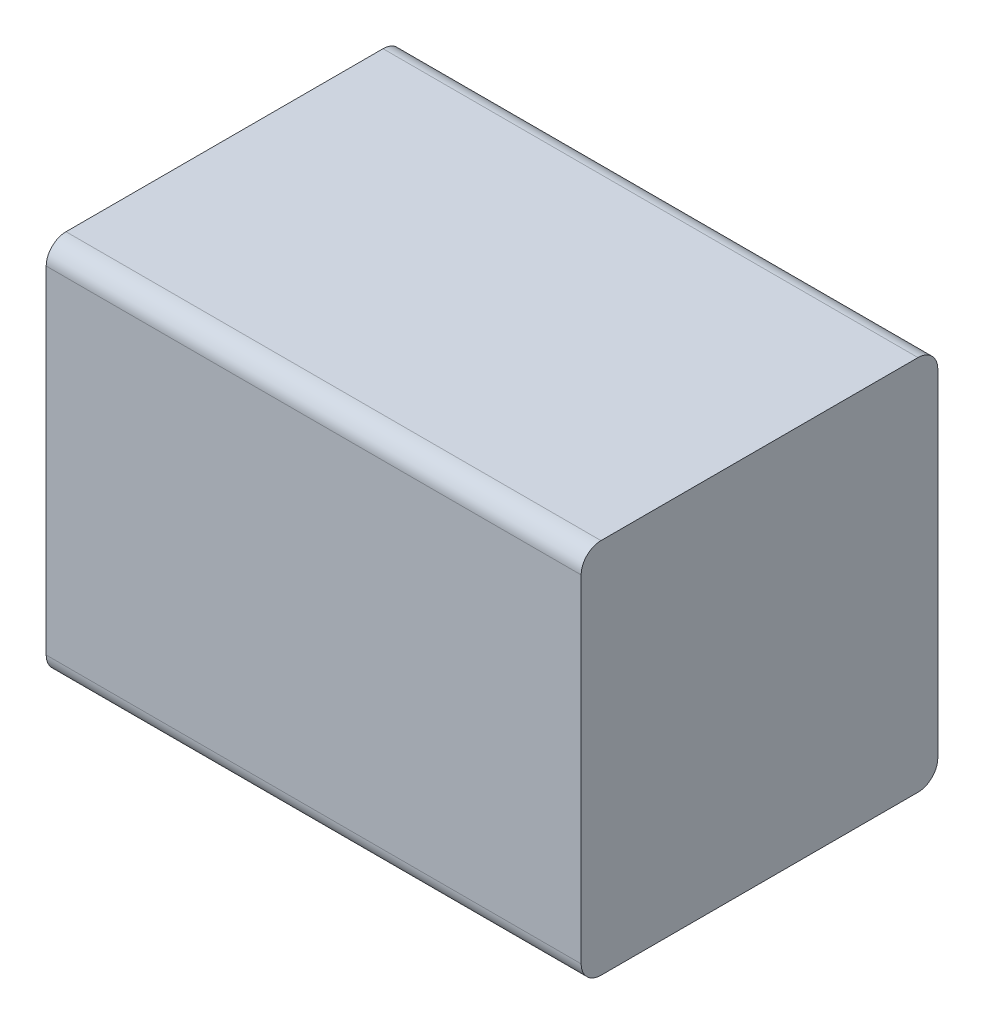
ISO-10303-21;
HEADER;
FILE_DESCRIPTION(('STEP AP214'),'2;1');
FILE_NAME('part.step','',(''),(''),'','','');
FILE_SCHEMA(('AUTOMOTIVE_DESIGN { 1 0 10303 214 1 1 1 1 }'));
ENDSEC;
DATA;
#1=APPLICATION_CONTEXT('core data for automotive mechanical design processes');
#2=APPLICATION_PROTOCOL_DEFINITION('international standard','automotive_design',2000,#1);
#3=PRODUCT_CONTEXT('',#1,'mechanical');
#4=PRODUCT('Part','Part','',(#3));
#5=PRODUCT_RELATED_PRODUCT_CATEGORY('part','',(#4));
#6=PRODUCT_DEFINITION_FORMATION('','',#4);
#7=PRODUCT_DEFINITION_CONTEXT('part definition',#1,'design');
#8=PRODUCT_DEFINITION('design','',#6,#7);
#9=PRODUCT_DEFINITION_SHAPE('','',#8);
#10=(LENGTH_UNIT() NAMED_UNIT(*) SI_UNIT(.MILLI.,.METRE.));
#11=(NAMED_UNIT(*) PLANE_ANGLE_UNIT() SI_UNIT($,.RADIAN.));
#12=(NAMED_UNIT(*) SI_UNIT($,.STERADIAN.) SOLID_ANGLE_UNIT());
#13=UNCERTAINTY_MEASURE_WITH_UNIT(LENGTH_MEASURE(1.E-05),#10,'distance_accuracy_value','');
#14=(GEOMETRIC_REPRESENTATION_CONTEXT(3) GLOBAL_UNCERTAINTY_ASSIGNED_CONTEXT((#13)) GLOBAL_UNIT_ASSIGNED_CONTEXT((#10,
#11,#12)) REPRESENTATION_CONTEXT('',''));
#15=CARTESIAN_POINT('',(0.,0.,0.));
#16=DIRECTION('',(0.,0.,1.));
#17=DIRECTION('',(1.,0.,0.));
#18=AXIS2_PLACEMENT_3D('',#15,#16,#17);
#19=CARTESIAN_POINT('',(0.,0.05,0.85));
#20=DIRECTION('',(1.,0.,0.));
#21=DIRECTION('',(0.,0.,-1.));
#22=AXIS2_PLACEMENT_3D('',#19,#20,#21);
#23=CYLINDRICAL_SURFACE('',#22,0.05);
#24=DIRECTION('',(1.,0.,0.));
#25=VECTOR('',#24,1.);
#26=CARTESIAN_POINT('',(0.,0.05,0.9));
#27=LINE('',#26,#25);
#28=CARTESIAN_POINT('',(0.2,0.05,0.9));
#29=VERTEX_POINT('',#28);
#30=CARTESIAN_POINT('',(1.55,0.05,0.9));
#31=VERTEX_POINT('',#30);
#32=EDGE_CURVE('E90',#29,#31,#27,.T.);
#33=ORIENTED_EDGE('',*,*,#32,.F.);
#34=CARTESIAN_POINT('',(0.2,0.05,0.85));
#35=DIRECTION('',(1.,0.,0.));
#36=DIRECTION('',(0.,0.,-1.));
#37=AXIS2_PLACEMENT_3D('',#34,#35,#36);
#38=CIRCLE('',#37,0.05);
#39=CARTESIAN_POINT('',(0.2,0.,0.85));
#40=VERTEX_POINT('',#39);
#41=EDGE_CURVE('E84',#29,#40,#38,.T.);
#42=ORIENTED_EDGE('',*,*,#41,.T.);
#43=DIRECTION('',(1.,0.,0.));
#44=VECTOR('',#43,1.);
#45=CARTESIAN_POINT('',(0.,0.,0.85));
#46=LINE('',#45,#44);
#47=CARTESIAN_POINT('',(1.55,0.,0.85));
#48=VERTEX_POINT('',#47);
#49=EDGE_CURVE('E86',#40,#48,#46,.T.);
#50=ORIENTED_EDGE('',*,*,#49,.T.);
#51=CARTESIAN_POINT('',(1.55,0.05,0.85));
#52=DIRECTION('',(1.,0.,0.));
#53=DIRECTION('',(0.,0.,-1.));
#54=AXIS2_PLACEMENT_3D('',#51,#52,#53);
#55=CIRCLE('',#54,0.05);
#56=EDGE_CURVE('E20',#48,#31,#55,.F.);
#57=ORIENTED_EDGE('',*,*,#56,.T.);
#58=EDGE_LOOP('',(#33,#42,#50,#57));
#59=FACE_BOUND('',#58,.T.);
#60=ADVANCED_FACE('F17',(#59),#23,.T.);
#61=CARTESIAN_POINT('',(0.,0.9,0.85));
#62=DIRECTION('',(1.,0.,0.));
#63=DIRECTION('',(0.,0.,-1.));
#64=AXIS2_PLACEMENT_3D('',#61,#62,#63);
#65=CYLINDRICAL_SURFACE('',#64,0.05);
#66=DIRECTION('',(1.,0.,0.));
#67=VECTOR('',#66,1.);
#68=CARTESIAN_POINT('',(0.,0.9,0.9));
#69=LINE('',#68,#67);
#70=CARTESIAN_POINT('',(1.55,0.9,0.9));
#71=VERTEX_POINT('',#70);
#72=CARTESIAN_POINT('',(0.2,0.9,0.9));
#73=VERTEX_POINT('',#72);
#74=EDGE_CURVE('E125',#71,#73,#69,.F.);
#75=ORIENTED_EDGE('',*,*,#74,.F.);
#76=CARTESIAN_POINT('',(1.55,0.9,0.85));
#77=DIRECTION('',(1.,0.,0.));
#78=DIRECTION('',(0.,0.,-1.));
#79=AXIS2_PLACEMENT_3D('',#76,#77,#78);
#80=CIRCLE('',#79,0.05);
#81=CARTESIAN_POINT('',(1.55,0.95,0.85));
#82=VERTEX_POINT('',#81);
#83=EDGE_CURVE('E91',#71,#82,#80,.F.);
#84=ORIENTED_EDGE('',*,*,#83,.T.);
#85=DIRECTION('',(1.,0.,0.));
#86=VECTOR('',#85,1.);
#87=CARTESIAN_POINT('',(0.,0.95,0.85));
#88=LINE('',#87,#86);
#89=CARTESIAN_POINT('',(0.2,0.95,0.85));
#90=VERTEX_POINT('',#89);
#91=EDGE_CURVE('E122',#90,#82,#88,.T.);
#92=ORIENTED_EDGE('',*,*,#91,.F.);
#93=CARTESIAN_POINT('',(0.2,0.9,0.85));
#94=DIRECTION('',(1.,0.,0.));
#95=DIRECTION('',(0.,0.,-1.));
#96=AXIS2_PLACEMENT_3D('',#93,#94,#95);
#97=CIRCLE('',#96,0.05);
#98=EDGE_CURVE('E136',#90,#73,#97,.T.);
#99=ORIENTED_EDGE('',*,*,#98,.T.);
#100=EDGE_LOOP('',(#75,#84,#92,#99));
#101=FACE_BOUND('',#100,.T.);
#102=ADVANCED_FACE('F140',(#101),#65,.T.);
#103=CARTESIAN_POINT('',(0.,0.,0.));
#104=DIRECTION('',(0.,1.,0.));
#105=DIRECTION('',(0.,0.,1.));
#106=AXIS2_PLACEMENT_3D('',#103,#104,#105);
#107=PLANE('',#106);
#108=ORIENTED_EDGE('',*,*,#49,.F.);
#109=DIRECTION('',(0.,0.,-1.));
#110=VECTOR('',#109,1.);
#111=CARTESIAN_POINT('',(0.2,0.,0.));
#112=LINE('',#111,#110);
#113=CARTESIAN_POINT('',(0.2,0.,0.05));
#114=VERTEX_POINT('',#113);
#115=EDGE_CURVE('E120',#40,#114,#112,.T.);
#116=ORIENTED_EDGE('',*,*,#115,.T.);
#117=DIRECTION('',(1.,0.,0.));
#118=VECTOR('',#117,1.);
#119=CARTESIAN_POINT('',(0.,0.,0.05));
#120=LINE('',#119,#118);
#121=CARTESIAN_POINT('',(1.55,0.,0.05));
#122=VERTEX_POINT('',#121);
#123=EDGE_CURVE('E94',#122,#114,#120,.F.);
#124=ORIENTED_EDGE('',*,*,#123,.F.);
#125=DIRECTION('',(0.,0.,-1.));
#126=VECTOR('',#125,1.);
#127=CARTESIAN_POINT('',(1.55,0.,0.));
#128=LINE('',#127,#126);
#129=EDGE_CURVE('E77',#48,#122,#128,.T.);
#130=ORIENTED_EDGE('',*,*,#129,.F.);
#131=EDGE_LOOP('',(#108,#116,#124,#130));
#132=FACE_BOUND('',#131,.T.);
#133=ADVANCED_FACE('F93',(#132),#107,.F.);
#134=CARTESIAN_POINT('',(0.,0.,0.9));
#135=DIRECTION('',(0.,0.,1.));
#136=DIRECTION('',(1.,0.,0.));
#137=AXIS2_PLACEMENT_3D('',#134,#135,#136);
#138=PLANE('',#137);
#139=DIRECTION('',(0.,1.,0.));
#140=VECTOR('',#139,1.);
#141=CARTESIAN_POINT('',(1.55,0.,0.9));
#142=LINE('',#141,#140);
#143=EDGE_CURVE('E80',#71,#31,#142,.F.);
#144=ORIENTED_EDGE('',*,*,#143,.F.);
#145=ORIENTED_EDGE('',*,*,#74,.T.);
#146=DIRECTION('',(0.,1.,0.));
#147=VECTOR('',#146,1.);
#148=CARTESIAN_POINT('',(0.2,0.,0.9));
#149=LINE('',#148,#147);
#150=EDGE_CURVE('E114',#73,#29,#149,.F.);
#151=ORIENTED_EDGE('',*,*,#150,.T.);
#152=ORIENTED_EDGE('',*,*,#32,.T.);
#153=EDGE_LOOP('',(#144,#145,#151,#152));
#154=FACE_BOUND('',#153,.T.);
#155=ADVANCED_FACE('F145',(#154),#138,.T.);
#156=CARTESIAN_POINT('',(0.,0.95,0.));
#157=DIRECTION('',(0.,1.,0.));
#158=DIRECTION('',(0.,0.,1.));
#159=AXIS2_PLACEMENT_3D('',#156,#157,#158);
#160=PLANE('',#159);
#161=ORIENTED_EDGE('',*,*,#91,.T.);
#162=DIRECTION('',(0.,0.,-1.));
#163=VECTOR('',#162,1.);
#164=CARTESIAN_POINT('',(1.55,0.95,0.));
#165=LINE('',#164,#163);
#166=CARTESIAN_POINT('',(1.55,0.95,0.05));
#167=VERTEX_POINT('',#166);
#168=EDGE_CURVE('E99',#167,#82,#165,.F.);
#169=ORIENTED_EDGE('',*,*,#168,.F.);
#170=DIRECTION('',(1.,0.,0.));
#171=VECTOR('',#170,1.);
#172=CARTESIAN_POINT('',(0.,0.95,0.05));
#173=LINE('',#172,#171);
#174=CARTESIAN_POINT('',(0.2,0.95,0.05));
#175=VERTEX_POINT('',#174);
#176=EDGE_CURVE('E123',#175,#167,#173,.T.);
#177=ORIENTED_EDGE('',*,*,#176,.F.);
#178=DIRECTION('',(0.,0.,-1.));
#179=VECTOR('',#178,1.);
#180=CARTESIAN_POINT('',(0.2,0.95,0.));
#181=LINE('',#180,#179);
#182=EDGE_CURVE('E117',#175,#90,#181,.F.);
#183=ORIENTED_EDGE('',*,*,#182,.T.);
#184=EDGE_LOOP('',(#161,#169,#177,#183));
#185=FACE_BOUND('',#184,.T.);
#186=ADVANCED_FACE('F174',(#185),#160,.T.);
#187=CARTESIAN_POINT('',(0.2,0.,0.));
#188=DIRECTION('',(1.,0.,0.));
#189=DIRECTION('',(0.,0.,-1.));
#190=AXIS2_PLACEMENT_3D('',#187,#188,#189);
#191=PLANE('',#190);
#192=ORIENTED_EDGE('',*,*,#150,.F.);
#193=ORIENTED_EDGE('',*,*,#98,.F.);
#194=ORIENTED_EDGE('',*,*,#182,.F.);
#195=CARTESIAN_POINT('',(0.2,0.9,0.05));
#196=DIRECTION('',(1.,0.,0.));
#197=DIRECTION('',(0.,0.,-1.));
#198=AXIS2_PLACEMENT_3D('',#195,#196,#197);
#199=CIRCLE('',#198,0.05);
#200=CARTESIAN_POINT('',(0.2,0.9,0.));
#201=VERTEX_POINT('',#200);
#202=EDGE_CURVE('E113',#201,#175,#199,.T.);
#203=ORIENTED_EDGE('',*,*,#202,.F.);
#204=DIRECTION('',(0.,1.,0.));
#205=VECTOR('',#204,1.);
#206=CARTESIAN_POINT('',(0.2,0.,0.));
#207=LINE('',#206,#205);
#208=CARTESIAN_POINT('',(0.2,0.05,0.));
#209=VERTEX_POINT('',#208);
#210=EDGE_CURVE('E108',#201,#209,#207,.F.);
#211=ORIENTED_EDGE('',*,*,#210,.T.);
#212=CARTESIAN_POINT('',(0.2,0.05,0.05));
#213=DIRECTION('',(1.,0.,0.));
#214=DIRECTION('',(0.,0.,-1.));
#215=AXIS2_PLACEMENT_3D('',#212,#213,#214);
#216=CIRCLE('',#215,0.05);
#217=EDGE_CURVE('E97',#114,#209,#216,.T.);
#218=ORIENTED_EDGE('',*,*,#217,.F.);
#219=ORIENTED_EDGE('',*,*,#115,.F.);
#220=ORIENTED_EDGE('',*,*,#41,.F.);
#221=EDGE_LOOP('',(#192,#193,#194,#203,#211,#218,#219,#220));
#222=FACE_BOUND('',#221,.T.);
#223=ADVANCED_FACE('F146',(#222),#191,.F.);
#224=CARTESIAN_POINT('',(0.,0.05,0.05));
#225=DIRECTION('',(1.,0.,0.));
#226=DIRECTION('',(0.,0.,-1.));
#227=AXIS2_PLACEMENT_3D('',#224,#225,#226);
#228=CYLINDRICAL_SURFACE('',#227,0.05);
#229=DIRECTION('',(1.,0.,0.));
#230=VECTOR('',#229,1.);
#231=CARTESIAN_POINT('',(0.,0.05,0.));
#232=LINE('',#231,#230);
#233=CARTESIAN_POINT('',(1.55,0.05,0.));
#234=VERTEX_POINT('',#233);
#235=EDGE_CURVE('E105',#209,#234,#232,.T.);
#236=ORIENTED_EDGE('',*,*,#235,.T.);
#237=CARTESIAN_POINT('',(1.55,0.05,0.05));
#238=DIRECTION('',(1.,0.,0.));
#239=DIRECTION('',(0.,0.,-1.));
#240=AXIS2_PLACEMENT_3D('',#237,#238,#239);
#241=CIRCLE('',#240,0.05);
#242=EDGE_CURVE('E96',#122,#234,#241,.T.);
#243=ORIENTED_EDGE('',*,*,#242,.F.);
#244=ORIENTED_EDGE('',*,*,#123,.T.);
#245=ORIENTED_EDGE('',*,*,#217,.T.);
#246=EDGE_LOOP('',(#236,#243,#244,#245));
#247=FACE_BOUND('',#246,.T.);
#248=ADVANCED_FACE('F166',(#247),#228,.T.);
#249=CARTESIAN_POINT('',(1.55,0.,0.));
#250=DIRECTION('',(1.,0.,0.));
#251=DIRECTION('',(0.,0.,-1.));
#252=AXIS2_PLACEMENT_3D('',#249,#250,#251);
#253=PLANE('',#252);
#254=ORIENTED_EDGE('',*,*,#143,.T.);
#255=ORIENTED_EDGE('',*,*,#56,.F.);
#256=ORIENTED_EDGE('',*,*,#129,.T.);
#257=ORIENTED_EDGE('',*,*,#242,.T.);
#258=DIRECTION('',(0.,1.,0.));
#259=VECTOR('',#258,1.);
#260=CARTESIAN_POINT('',(1.55,0.,0.));
#261=LINE('',#260,#259);
#262=CARTESIAN_POINT('',(1.55,0.9,0.));
#263=VERTEX_POINT('',#262);
#264=EDGE_CURVE('E26',#234,#263,#261,.T.);
#265=ORIENTED_EDGE('',*,*,#264,.T.);
#266=CARTESIAN_POINT('',(1.55,0.9,0.05));
#267=DIRECTION('',(1.,0.,0.));
#268=DIRECTION('',(0.,0.,-1.));
#269=AXIS2_PLACEMENT_3D('',#266,#267,#268);
#270=CIRCLE('',#269,0.05);
#271=EDGE_CURVE('E34',#167,#263,#270,.F.);
#272=ORIENTED_EDGE('',*,*,#271,.F.);
#273=ORIENTED_EDGE('',*,*,#168,.T.);
#274=ORIENTED_EDGE('',*,*,#83,.F.);
#275=EDGE_LOOP('',(#254,#255,#256,#257,#265,#272,#273,#274));
#276=FACE_BOUND('',#275,.T.);
#277=ADVANCED_FACE('F75',(#276),#253,.T.);
#278=CARTESIAN_POINT('',(0.,0.9,0.05));
#279=DIRECTION('',(1.,0.,0.));
#280=DIRECTION('',(0.,0.,-1.));
#281=AXIS2_PLACEMENT_3D('',#278,#279,#280);
#282=CYLINDRICAL_SURFACE('',#281,0.05);
#283=DIRECTION('',(1.,0.,0.));
#284=VECTOR('',#283,1.);
#285=CARTESIAN_POINT('',(0.,0.9,0.));
#286=LINE('',#285,#284);
#287=EDGE_CURVE('E11',#263,#201,#286,.F.);
#288=ORIENTED_EDGE('',*,*,#287,.T.);
#289=ORIENTED_EDGE('',*,*,#202,.T.);
#290=ORIENTED_EDGE('',*,*,#176,.T.);
#291=ORIENTED_EDGE('',*,*,#271,.T.);
#292=EDGE_LOOP('',(#288,#289,#290,#291));
#293=FACE_BOUND('',#292,.T.);
#294=ADVANCED_FACE('F157',(#293),#282,.T.);
#295=CARTESIAN_POINT('',(0.,0.,0.));
#296=DIRECTION('',(0.,0.,1.));
#297=DIRECTION('',(1.,0.,0.));
#298=AXIS2_PLACEMENT_3D('',#295,#296,#297);
#299=PLANE('',#298);
#300=ORIENTED_EDGE('',*,*,#264,.F.);
#301=ORIENTED_EDGE('',*,*,#235,.F.);
#302=ORIENTED_EDGE('',*,*,#210,.F.);
#303=ORIENTED_EDGE('',*,*,#287,.F.);
#304=EDGE_LOOP('',(#300,#301,#302,#303));
#305=FACE_BOUND('',#304,.T.);
#306=ADVANCED_FACE('F155',(#305),#299,.F.);
#307=CLOSED_SHELL('',(#60,#102,#133,#155,#186,#223,#248,#277,#294,#306));
#308=MANIFOLD_SOLID_BREP('B1',#307);
#309=ADVANCED_BREP_SHAPE_REPRESENTATION('',(#18,#308),#14);
#310=SHAPE_DEFINITION_REPRESENTATION(#9,#309);
ENDSEC;
END-ISO-10303-21;
